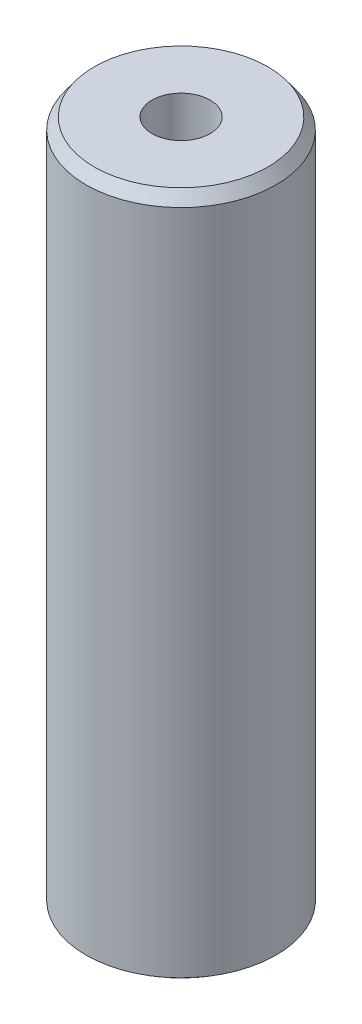
ISO-10303-21;
HEADER;
FILE_DESCRIPTION(('STEP AP214'),'2;1');
FILE_NAME('part.step','',(''),(''),'','','');
FILE_SCHEMA(('AUTOMOTIVE_DESIGN { 1 0 10303 214 1 1 1 1 }'));
ENDSEC;
DATA;
#1=APPLICATION_CONTEXT('core data for automotive mechanical design processes');
#2=APPLICATION_PROTOCOL_DEFINITION('international standard','automotive_design',2000,#1);
#3=PRODUCT_CONTEXT('',#1,'mechanical');
#4=PRODUCT('Part','Part','',(#3));
#5=PRODUCT_RELATED_PRODUCT_CATEGORY('part','',(#4));
#6=PRODUCT_DEFINITION_FORMATION('','',#4);
#7=PRODUCT_DEFINITION_CONTEXT('part definition',#1,'design');
#8=PRODUCT_DEFINITION('design','',#6,#7);
#9=PRODUCT_DEFINITION_SHAPE('','',#8);
#10=(LENGTH_UNIT() NAMED_UNIT(*) SI_UNIT(.MILLI.,.METRE.));
#11=(NAMED_UNIT(*) PLANE_ANGLE_UNIT() SI_UNIT($,.RADIAN.));
#12=(NAMED_UNIT(*) SI_UNIT($,.STERADIAN.) SOLID_ANGLE_UNIT());
#13=UNCERTAINTY_MEASURE_WITH_UNIT(LENGTH_MEASURE(1.E-05),#10,'distance_accuracy_value','');
#14=(GEOMETRIC_REPRESENTATION_CONTEXT(3) GLOBAL_UNCERTAINTY_ASSIGNED_CONTEXT((#13)) GLOBAL_UNIT_ASSIGNED_CONTEXT((#10,
#11,#12)) REPRESENTATION_CONTEXT('',''));
#15=CARTESIAN_POINT('',(0.,0.,0.));
#16=DIRECTION('',(0.,0.,1.));
#17=DIRECTION('',(1.,0.,0.));
#18=AXIS2_PLACEMENT_3D('',#15,#16,#17);
#19=CARTESIAN_POINT('',(0.,289.018235415489,0.));
#20=DIRECTION('',(0.,-1.,0.));
#21=DIRECTION('',(0.,0.,-1.));
#22=AXIS2_PLACEMENT_3D('',#19,#20,#21);
#23=CYLINDRICAL_SURFACE('',#22,40.);
#24=CARTESIAN_POINT('',(0.,284.22980197876,0.));
#25=DIRECTION('',(0.,1.,0.));
#26=DIRECTION('',(0.,0.,1.));
#27=AXIS2_PLACEMENT_3D('',#24,#25,#26);
#28=CIRCLE('',#27,40.);
#29=CARTESIAN_POINT('',(0.,284.22980197876,40.));
#30=VERTEX_POINT('',#29);
#31=EDGE_CURVE('E50',#30,#30,#28,.F.);
#32=ORIENTED_EDGE('',*,*,#31,.T.);
#33=EDGE_LOOP('',(#32));
#34=FACE_BOUND('',#33,.T.);
#35=CARTESIAN_POINT('',(0.,3.45096029581227,0.));
#36=DIRECTION('',(0.,1.,0.));
#37=DIRECTION('',(0.,0.,1.));
#38=AXIS2_PLACEMENT_3D('',#35,#36,#37);
#39=CIRCLE('',#38,40.);
#40=CARTESIAN_POINT('',(0.,3.45096029581227,40.));
#41=VERTEX_POINT('',#40);
#42=EDGE_CURVE('E51',#41,#41,#39,.T.);
#43=ORIENTED_EDGE('',*,*,#42,.T.);
#44=EDGE_LOOP('',(#43));
#45=FACE_BOUND('',#44,.T.);
#46=ADVANCED_FACE('F39',(#34,#45),#23,.T.);
#47=CARTESIAN_POINT('',(0.,289.018235415489,0.));
#48=DIRECTION('',(0.,1.,0.));
#49=DIRECTION('',(0.,0.,1.));
#50=AXIS2_PLACEMENT_3D('',#47,#48,#49);
#51=PLANE('',#50);
#52=CARTESIAN_POINT('',(0.,289.018235415489,0.));
#53=DIRECTION('',(0.,1.,0.));
#54=DIRECTION('',(0.,0.,1.));
#55=AXIS2_PLACEMENT_3D('',#52,#53,#54);
#56=CIRCLE('',#55,36.5490397041878);
#57=CARTESIAN_POINT('',(0.,289.018235415489,36.5490397041878));
#58=VERTEX_POINT('',#57);
#59=EDGE_CURVE('E54',#58,#58,#56,.T.);
#60=ORIENTED_EDGE('',*,*,#59,.T.);
#61=EDGE_LOOP('',(#60));
#62=FACE_BOUND('',#61,.T.);
#63=CARTESIAN_POINT('',(0.,289.018235415489,0.));
#64=DIRECTION('',(0.,1.,0.));
#65=DIRECTION('',(0.,0.,1.));
#66=AXIS2_PLACEMENT_3D('',#63,#64,#65);
#67=CIRCLE('',#66,12.2432304165549);
#68=CARTESIAN_POINT('',(0.,289.018235415489,12.2432304165549));
#69=VERTEX_POINT('',#68);
#70=EDGE_CURVE('E58',#69,#69,#67,.T.);
#71=ORIENTED_EDGE('',*,*,#70,.F.);
#72=EDGE_LOOP('',(#71));
#73=FACE_BOUND('',#72,.T.);
#74=ADVANCED_FACE('F69',(#62,#73),#51,.T.);
#75=CARTESIAN_POINT('',(0.,0.,0.));
#76=DIRECTION('',(0.,1.,0.));
#77=DIRECTION('',(0.,0.,1.));
#78=AXIS2_PLACEMENT_3D('',#75,#76,#77);
#79=PLANE('',#78);
#80=CARTESIAN_POINT('',(0.,0.,0.));
#81=DIRECTION('',(0.,1.,0.));
#82=DIRECTION('',(0.,0.,1.));
#83=AXIS2_PLACEMENT_3D('',#80,#81,#82);
#84=CIRCLE('',#83,35.2115665632714);
#85=CARTESIAN_POINT('',(0.,0.,35.2115665632714));
#86=VERTEX_POINT('',#85);
#87=EDGE_CURVE('E10',#86,#86,#84,.F.);
#88=ORIENTED_EDGE('',*,*,#87,.T.);
#89=EDGE_LOOP('',(#88));
#90=FACE_BOUND('',#89,.T.);
#91=CARTESIAN_POINT('',(0.,0.,0.));
#92=DIRECTION('',(0.,1.,0.));
#93=DIRECTION('',(0.,0.,1.));
#94=AXIS2_PLACEMENT_3D('',#91,#92,#93);
#95=CIRCLE('',#94,12.2432304165549);
#96=CARTESIAN_POINT('',(0.,0.,12.2432304165549));
#97=VERTEX_POINT('',#96);
#98=EDGE_CURVE('E63',#97,#97,#95,.T.);
#99=ORIENTED_EDGE('',*,*,#98,.T.);
#100=EDGE_LOOP('',(#99));
#101=FACE_BOUND('',#100,.T.);
#102=ADVANCED_FACE('F75',(#90,#101),#79,.F.);
#103=CARTESIAN_POINT('',(0.,289.018235415489,0.));
#104=DIRECTION('',(0.,-1.,0.));
#105=DIRECTION('',(0.,0.,-1.));
#106=AXIS2_PLACEMENT_3D('',#103,#104,#105);
#107=CYLINDRICAL_SURFACE('',#106,12.2432304165549);
#108=ORIENTED_EDGE('',*,*,#70,.T.);
#109=EDGE_LOOP('',(#108));
#110=FACE_BOUND('',#109,.T.);
#111=ORIENTED_EDGE('',*,*,#98,.F.);
#112=EDGE_LOOP('',(#111));
#113=FACE_BOUND('',#112,.T.);
#114=ADVANCED_FACE('F70',(#110,#113),#107,.F.);
#115=CARTESIAN_POINT('',(0.,289.018235415489,0.));
#116=DIRECTION('',(0.,-1.,0.));
#117=DIRECTION('',(0.,0.,-1.));
#118=AXIS2_PLACEMENT_3D('',#115,#116,#117);
#119=CONICAL_SURFACE('',#118,36.5490397041878,0.624475158668826);
#120=ORIENTED_EDGE('',*,*,#31,.F.);
#121=EDGE_LOOP('',(#120));
#122=FACE_BOUND('',#121,.T.);
#123=ORIENTED_EDGE('',*,*,#59,.F.);
#124=EDGE_LOOP('',(#123));
#125=FACE_BOUND('',#124,.T.);
#126=ADVANCED_FACE('F81',(#122,#125),#119,.T.);
#127=CARTESIAN_POINT('',(0.,3.45096029581227,0.));
#128=DIRECTION('',(0.,1.,0.));
#129=DIRECTION('',(0.,0.,1.));
#130=AXIS2_PLACEMENT_3D('',#127,#128,#129);
#131=CONICAL_SURFACE('',#130,40.,0.946321168126074);
#132=ORIENTED_EDGE('',*,*,#87,.F.);
#133=EDGE_LOOP('',(#132));
#134=FACE_BOUND('',#133,.T.);
#135=ORIENTED_EDGE('',*,*,#42,.F.);
#136=EDGE_LOOP('',(#135));
#137=FACE_BOUND('',#136,.T.);
#138=ADVANCED_FACE('F45',(#134,#137),#131,.T.);
#139=CLOSED_SHELL('',(#46,#74,#102,#114,#126,#138));
#140=MANIFOLD_SOLID_BREP('B2',#139);
#141=ADVANCED_BREP_SHAPE_REPRESENTATION('',(#18,#140),#14);
#142=SHAPE_DEFINITION_REPRESENTATION(#9,#141);
ENDSEC;
END-ISO-10303-21;
